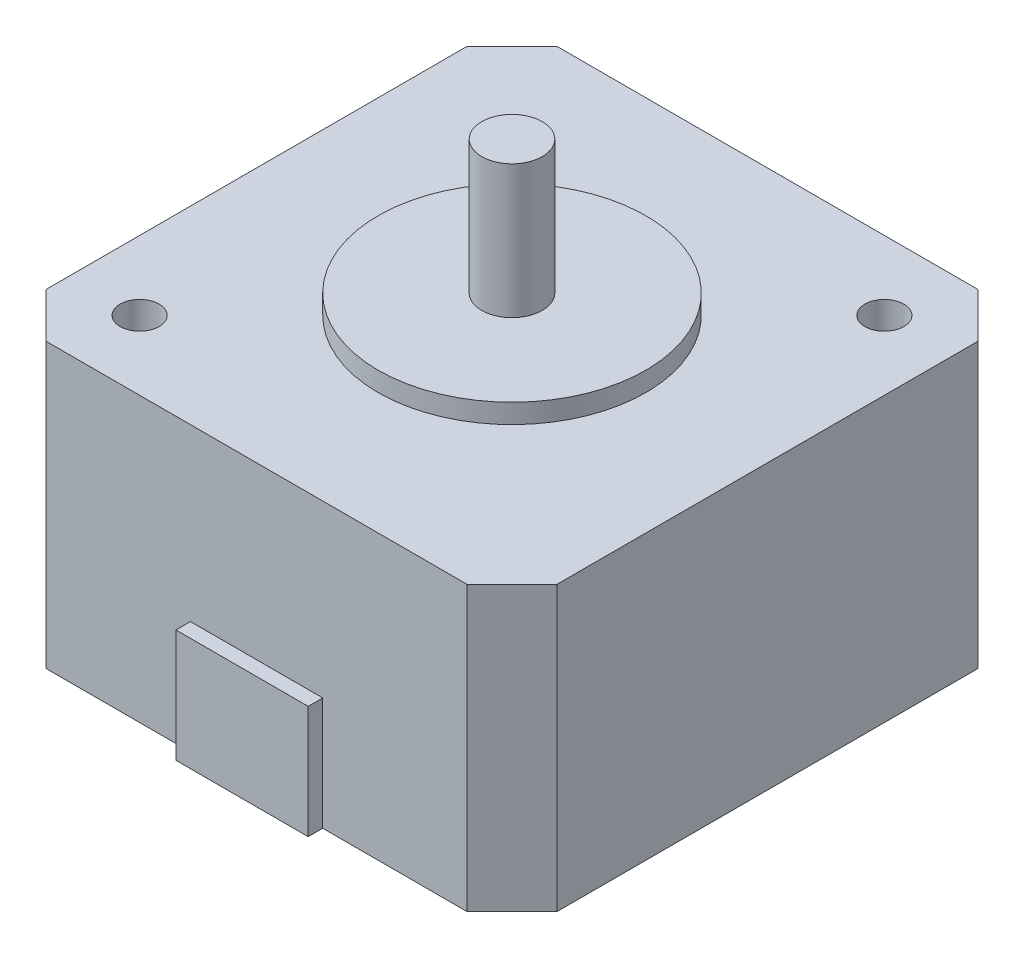
ISO-10303-21;
HEADER;
FILE_DESCRIPTION(('STEP AP214'),'2;1');
FILE_NAME('part.step','',(''),(''),'','','');
FILE_SCHEMA(('AUTOMOTIVE_DESIGN { 1 0 10303 214 1 1 1 1 }'));
ENDSEC;
DATA;
#1=APPLICATION_CONTEXT('core data for automotive mechanical design processes');
#2=APPLICATION_PROTOCOL_DEFINITION('international standard','automotive_design',2000,#1);
#3=PRODUCT_CONTEXT('',#1,'mechanical');
#4=PRODUCT('Part','Part','',(#3));
#5=PRODUCT_RELATED_PRODUCT_CATEGORY('part','',(#4));
#6=PRODUCT_DEFINITION_FORMATION('','',#4);
#7=PRODUCT_DEFINITION_CONTEXT('part definition',#1,'design');
#8=PRODUCT_DEFINITION('design','',#6,#7);
#9=PRODUCT_DEFINITION_SHAPE('','',#8);
#10=(LENGTH_UNIT() NAMED_UNIT(*) SI_UNIT(.MILLI.,.METRE.));
#11=(NAMED_UNIT(*) PLANE_ANGLE_UNIT() SI_UNIT($,.RADIAN.));
#12=(NAMED_UNIT(*) SI_UNIT($,.STERADIAN.) SOLID_ANGLE_UNIT());
#13=UNCERTAINTY_MEASURE_WITH_UNIT(LENGTH_MEASURE(1.E-05),#10,'distance_accuracy_value','');
#14=(GEOMETRIC_REPRESENTATION_CONTEXT(3) GLOBAL_UNCERTAINTY_ASSIGNED_CONTEXT((#13)) GLOBAL_UNIT_ASSIGNED_CONTEXT((#10,
#11,#12)) REPRESENTATION_CONTEXT('',''));
#15=CARTESIAN_POINT('',(0.,0.,0.));
#16=DIRECTION('',(0.,0.,1.));
#17=DIRECTION('',(1.,0.,0.));
#18=AXIS2_PLACEMENT_3D('',#15,#16,#17);
#19=CARTESIAN_POINT('',(0.,25.,0.));
#20=DIRECTION('',(0.,1.,0.));
#21=DIRECTION('',(0.,0.,1.));
#22=AXIS2_PLACEMENT_3D('',#19,#20,#21);
#23=PLANE('',#22);
#24=CARTESIAN_POINT('',(0.,25.,0.));
#25=DIRECTION('',(0.,1.,0.));
#26=DIRECTION('',(0.,0.,1.));
#27=AXIS2_PLACEMENT_3D('',#24,#25,#26);
#28=CIRCLE('',#27,11.05);
#29=CARTESIAN_POINT('',(0.,25.,11.05));
#30=VERTEX_POINT('',#29);
#31=EDGE_CURVE('E258',#30,#30,#28,.T.);
#32=ORIENTED_EDGE('',*,*,#31,.T.);
#33=EDGE_LOOP('',(#32));
#34=FACE_BOUND('',#33,.T.);
#35=CARTESIAN_POINT('',(0.,25.,0.));
#36=DIRECTION('',(0.,1.,0.));
#37=DIRECTION('',(0.,0.,1.));
#38=AXIS2_PLACEMENT_3D('',#35,#36,#37);
#39=CIRCLE('',#38,2.5);
#40=CARTESIAN_POINT('',(0.,25.,2.5));
#41=VERTEX_POINT('',#40);
#42=EDGE_CURVE('E265',#41,#41,#39,.T.);
#43=ORIENTED_EDGE('',*,*,#42,.F.);
#44=EDGE_LOOP('',(#43));
#45=FACE_BOUND('',#44,.T.);
#46=ADVANCED_FACE('F33',(#34,#45),#23,.T.);
#47=CARTESIAN_POINT('',(0.,23.4,0.));
#48=DIRECTION('',(0.,1.,0.));
#49=DIRECTION('',(0.,0.,1.));
#50=AXIS2_PLACEMENT_3D('',#47,#48,#49);
#51=PLANE('',#50);
#52=DIRECTION('',(-0.707106781186546,0.,-0.707106781186549));
#53=VECTOR('',#52,1.);
#54=CARTESIAN_POINT('',(17.385,23.4,-21.085));
#55=LINE('',#54,#53);
#56=CARTESIAN_POINT('',(21.085,23.4,-17.385));
#57=VERTEX_POINT('',#56);
#58=CARTESIAN_POINT('',(17.385,23.4,-21.085));
#59=VERTEX_POINT('',#58);
#60=EDGE_CURVE('E170',#57,#59,#55,.T.);
#61=ORIENTED_EDGE('',*,*,#60,.T.);
#62=DIRECTION('',(-1.,0.,0.));
#63=VECTOR('',#62,1.);
#64=CARTESIAN_POINT('',(-17.385,23.4,-21.085));
#65=LINE('',#64,#63);
#66=CARTESIAN_POINT('',(-17.385,23.4,-21.085));
#67=VERTEX_POINT('',#66);
#68=EDGE_CURVE('E173',#59,#67,#65,.T.);
#69=ORIENTED_EDGE('',*,*,#68,.T.);
#70=DIRECTION('',(-0.707106781186548,0.,0.707106781186547));
#71=VECTOR('',#70,1.);
#72=CARTESIAN_POINT('',(-21.085,23.4,-17.385));
#73=LINE('',#72,#71);
#74=CARTESIAN_POINT('',(-21.085,23.4,-17.385));
#75=VERTEX_POINT('',#74);
#76=EDGE_CURVE('E176',#67,#75,#73,.T.);
#77=ORIENTED_EDGE('',*,*,#76,.T.);
#78=DIRECTION('',(0.,0.,1.));
#79=VECTOR('',#78,1.);
#80=CARTESIAN_POINT('',(-21.085,23.4,-17.385));
#81=LINE('',#80,#79);
#82=CARTESIAN_POINT('',(-21.085,23.4,17.385));
#83=VERTEX_POINT('',#82);
#84=EDGE_CURVE('E178',#75,#83,#81,.T.);
#85=ORIENTED_EDGE('',*,*,#84,.T.);
#86=DIRECTION('',(0.707106781186547,0.,0.707106781186547));
#87=VECTOR('',#86,1.);
#88=CARTESIAN_POINT('',(-21.085,23.4,17.385));
#89=LINE('',#88,#87);
#90=CARTESIAN_POINT('',(-17.385,23.4,21.085));
#91=VERTEX_POINT('',#90);
#92=EDGE_CURVE('E180',#83,#91,#89,.T.);
#93=ORIENTED_EDGE('',*,*,#92,.T.);
#94=DIRECTION('',(1.,0.,0.));
#95=VECTOR('',#94,1.);
#96=CARTESIAN_POINT('',(-17.385,23.4,21.085));
#97=LINE('',#96,#95);
#98=CARTESIAN_POINT('',(17.385,23.4,21.085));
#99=VERTEX_POINT('',#98);
#100=EDGE_CURVE('E182',#91,#99,#97,.T.);
#101=ORIENTED_EDGE('',*,*,#100,.T.);
#102=DIRECTION('',(0.707106781186547,0.,-0.707106781186548));
#103=VECTOR('',#102,1.);
#104=CARTESIAN_POINT('',(17.385,23.4,21.085));
#105=LINE('',#104,#103);
#106=CARTESIAN_POINT('',(21.085,23.4,17.385));
#107=VERTEX_POINT('',#106);
#108=EDGE_CURVE('E184',#99,#107,#105,.T.);
#109=ORIENTED_EDGE('',*,*,#108,.T.);
#110=DIRECTION('',(0.,0.,-1.));
#111=VECTOR('',#110,1.);
#112=CARTESIAN_POINT('',(21.085,23.4,-17.385));
#113=LINE('',#112,#111);
#114=EDGE_CURVE('E186',#107,#57,#113,.T.);
#115=ORIENTED_EDGE('',*,*,#114,.T.);
#116=EDGE_LOOP('',(#61,#69,#77,#85,#93,#101,#109,#115));
#117=FACE_BOUND('',#116,.T.);
#118=CARTESIAN_POINT('',(-15.37,23.4,15.37));
#119=DIRECTION('',(0.,1.,0.));
#120=DIRECTION('',(0.,0.,1.));
#121=AXIS2_PLACEMENT_3D('',#118,#119,#120);
#122=CIRCLE('',#121,1.61);
#123=CARTESIAN_POINT('',(-15.37,23.4,16.98));
#124=VERTEX_POINT('',#123);
#125=EDGE_CURVE('E252',#124,#124,#122,.T.);
#126=ORIENTED_EDGE('',*,*,#125,.F.);
#127=EDGE_LOOP('',(#126));
#128=FACE_BOUND('',#127,.T.);
#129=CARTESIAN_POINT('',(15.37,23.4,-15.37));
#130=DIRECTION('',(0.,1.,0.));
#131=DIRECTION('',(0.,0.,1.));
#132=AXIS2_PLACEMENT_3D('',#129,#130,#131);
#133=CIRCLE('',#132,1.61);
#134=CARTESIAN_POINT('',(15.37,23.4,-13.76));
#135=VERTEX_POINT('',#134);
#136=EDGE_CURVE('E255',#135,#135,#133,.T.);
#137=ORIENTED_EDGE('',*,*,#136,.F.);
#138=EDGE_LOOP('',(#137));
#139=FACE_BOUND('',#138,.T.);
#140=CARTESIAN_POINT('',(0.,23.4,0.));
#141=DIRECTION('',(0.,1.,0.));
#142=DIRECTION('',(0.,0.,1.));
#143=AXIS2_PLACEMENT_3D('',#140,#141,#142);
#144=CIRCLE('',#143,11.05);
#145=CARTESIAN_POINT('',(0.,23.4,11.05));
#146=VERTEX_POINT('',#145);
#147=EDGE_CURVE('E259',#146,#146,#144,.T.);
#148=ORIENTED_EDGE('',*,*,#147,.F.);
#149=EDGE_LOOP('',(#148));
#150=FACE_BOUND('',#149,.T.);
#151=ADVANCED_FACE('F241',(#117,#128,#139,#150),#51,.T.);
#152=CARTESIAN_POINT('',(-17.385,23.4,21.085));
#153=DIRECTION('',(0.,0.,-1.));
#154=DIRECTION('',(-1.,0.,0.));
#155=AXIS2_PLACEMENT_3D('',#152,#153,#154);
#156=PLANE('',#155);
#157=DIRECTION('',(0.,-1.,0.));
#158=VECTOR('',#157,1.);
#159=CARTESIAN_POINT('',(-5.46,9.32,21.085));
#160=LINE('',#159,#158);
#161=CARTESIAN_POINT('',(-5.46,9.32,21.085));
#162=VERTEX_POINT('',#161);
#163=CARTESIAN_POINT('',(-5.46,0.,21.085));
#164=VERTEX_POINT('',#163);
#165=EDGE_CURVE('E50',#162,#164,#160,.T.);
#166=ORIENTED_EDGE('',*,*,#165,.F.);
#167=DIRECTION('',(-1.,0.,0.));
#168=VECTOR('',#167,1.);
#169=CARTESIAN_POINT('',(-5.46,9.32,21.085));
#170=LINE('',#169,#168);
#171=CARTESIAN_POINT('',(5.46,9.31999999999999,21.085));
#172=VERTEX_POINT('',#171);
#173=EDGE_CURVE('E144',#172,#162,#170,.T.);
#174=ORIENTED_EDGE('',*,*,#173,.F.);
#175=DIRECTION('',(0.,1.,0.));
#176=VECTOR('',#175,1.);
#177=CARTESIAN_POINT('',(5.46,9.31999999999999,21.085));
#178=LINE('',#177,#176);
#179=CARTESIAN_POINT('',(5.46,0.,21.085));
#180=VERTEX_POINT('',#179);
#181=EDGE_CURVE('E56',#180,#172,#178,.T.);
#182=ORIENTED_EDGE('',*,*,#181,.F.);
#183=DIRECTION('',(1.,0.,0.));
#184=VECTOR('',#183,1.);
#185=CARTESIAN_POINT('',(-17.385,0.,21.085));
#186=LINE('',#185,#184);
#187=CARTESIAN_POINT('',(17.385,0.,21.085));
#188=VERTEX_POINT('',#187);
#189=EDGE_CURVE('E196',#180,#188,#186,.T.);
#190=ORIENTED_EDGE('',*,*,#189,.T.);
#191=DIRECTION('',(0.,-1.,0.));
#192=VECTOR('',#191,1.);
#193=CARTESIAN_POINT('',(17.385,23.4,21.085));
#194=LINE('',#193,#192);
#195=EDGE_CURVE('E218',#99,#188,#194,.T.);
#196=ORIENTED_EDGE('',*,*,#195,.F.);
#197=ORIENTED_EDGE('',*,*,#100,.F.);
#198=DIRECTION('',(0.,-1.,0.));
#199=VECTOR('',#198,1.);
#200=CARTESIAN_POINT('',(-17.385,23.4,21.085));
#201=LINE('',#200,#199);
#202=CARTESIAN_POINT('',(-17.385,0.,21.085));
#203=VERTEX_POINT('',#202);
#204=EDGE_CURVE('E215',#91,#203,#201,.T.);
#205=ORIENTED_EDGE('',*,*,#204,.T.);
#206=EDGE_CURVE('E205',#203,#164,#186,.T.);
#207=ORIENTED_EDGE('',*,*,#206,.T.);
#208=EDGE_LOOP('',(#166,#174,#182,#190,#196,#197,#205,#207));
#209=FACE_BOUND('',#208,.T.);
#210=ADVANCED_FACE('F247',(#209),#156,.F.);
#211=CARTESIAN_POINT('',(17.385,23.4,-21.085));
#212=DIRECTION('',(-0.707106781186549,0.,0.707106781186546));
#213=DIRECTION('',(0.707106781186546,0.,0.707106781186549));
#214=AXIS2_PLACEMENT_3D('',#211,#212,#213);
#215=PLANE('',#214);
#216=DIRECTION('',(-0.707106781186546,0.,-0.707106781186549));
#217=VECTOR('',#216,1.);
#218=CARTESIAN_POINT('',(17.385,0.,-21.085));
#219=LINE('',#218,#217);
#220=CARTESIAN_POINT('',(21.085,0.,-17.385));
#221=VERTEX_POINT('',#220);
#222=CARTESIAN_POINT('',(17.385,0.,-21.085));
#223=VERTEX_POINT('',#222);
#224=EDGE_CURVE('E147',#221,#223,#219,.T.);
#225=ORIENTED_EDGE('',*,*,#224,.T.);
#226=DIRECTION('',(0.,-1.,0.));
#227=VECTOR('',#226,1.);
#228=CARTESIAN_POINT('',(17.385,23.4,-21.085));
#229=LINE('',#228,#227);
#230=EDGE_CURVE('E11',#59,#223,#229,.T.);
#231=ORIENTED_EDGE('',*,*,#230,.F.);
#232=ORIENTED_EDGE('',*,*,#60,.F.);
#233=DIRECTION('',(0.,-1.,0.));
#234=VECTOR('',#233,1.);
#235=CARTESIAN_POINT('',(21.085,23.4,-17.385));
#236=LINE('',#235,#234);
#237=EDGE_CURVE('E187',#57,#221,#236,.T.);
#238=ORIENTED_EDGE('',*,*,#237,.T.);
#239=EDGE_LOOP('',(#225,#231,#232,#238));
#240=FACE_BOUND('',#239,.T.);
#241=ADVANCED_FACE('F35',(#240),#215,.F.);
#242=CARTESIAN_POINT('',(-17.385,23.4,-21.085));
#243=DIRECTION('',(0.,0.,1.));
#244=DIRECTION('',(1.,0.,0.));
#245=AXIS2_PLACEMENT_3D('',#242,#243,#244);
#246=PLANE('',#245);
#247=DIRECTION('',(-1.,0.,0.));
#248=VECTOR('',#247,1.);
#249=CARTESIAN_POINT('',(-17.385,0.,-21.085));
#250=LINE('',#249,#248);
#251=CARTESIAN_POINT('',(-17.385,0.,-21.085));
#252=VERTEX_POINT('',#251);
#253=EDGE_CURVE('E150',#223,#252,#250,.T.);
#254=ORIENTED_EDGE('',*,*,#253,.T.);
#255=DIRECTION('',(0.,-1.,0.));
#256=VECTOR('',#255,1.);
#257=CARTESIAN_POINT('',(-17.385,23.4,-21.085));
#258=LINE('',#257,#256);
#259=EDGE_CURVE('E42',#67,#252,#258,.T.);
#260=ORIENTED_EDGE('',*,*,#259,.F.);
#261=ORIENTED_EDGE('',*,*,#68,.F.);
#262=ORIENTED_EDGE('',*,*,#230,.T.);
#263=EDGE_LOOP('',(#254,#260,#261,#262));
#264=FACE_BOUND('',#263,.T.);
#265=ADVANCED_FACE('F329',(#264),#246,.F.);
#266=CARTESIAN_POINT('',(-21.085,23.4,-17.385));
#267=DIRECTION('',(0.707106781186547,0.,0.707106781186548));
#268=DIRECTION('',(0.707106781186548,0.,-0.707106781186547));
#269=AXIS2_PLACEMENT_3D('',#266,#267,#268);
#270=PLANE('',#269);
#271=DIRECTION('',(-0.707106781186548,0.,0.707106781186547));
#272=VECTOR('',#271,1.);
#273=CARTESIAN_POINT('',(-21.085,0.,-17.385));
#274=LINE('',#273,#272);
#275=CARTESIAN_POINT('',(-21.085,0.,-17.385));
#276=VERTEX_POINT('',#275);
#277=EDGE_CURVE('E190',#252,#276,#274,.T.);
#278=ORIENTED_EDGE('',*,*,#277,.T.);
#279=DIRECTION('',(0.,-1.,0.));
#280=VECTOR('',#279,1.);
#281=CARTESIAN_POINT('',(-21.085,23.4,-17.385));
#282=LINE('',#281,#280);
#283=EDGE_CURVE('E209',#75,#276,#282,.T.);
#284=ORIENTED_EDGE('',*,*,#283,.F.);
#285=ORIENTED_EDGE('',*,*,#76,.F.);
#286=ORIENTED_EDGE('',*,*,#259,.T.);
#287=EDGE_LOOP('',(#278,#284,#285,#286));
#288=FACE_BOUND('',#287,.T.);
#289=ADVANCED_FACE('F326',(#288),#270,.F.);
#290=CARTESIAN_POINT('',(-21.085,23.4,-17.385));
#291=DIRECTION('',(1.,0.,0.));
#292=DIRECTION('',(0.,0.,-1.));
#293=AXIS2_PLACEMENT_3D('',#290,#291,#292);
#294=PLANE('',#293);
#295=DIRECTION('',(0.,0.,1.));
#296=VECTOR('',#295,1.);
#297=CARTESIAN_POINT('',(-21.085,0.,-17.385));
#298=LINE('',#297,#296);
#299=CARTESIAN_POINT('',(-21.085,0.,17.385));
#300=VERTEX_POINT('',#299);
#301=EDGE_CURVE('E192',#276,#300,#298,.T.);
#302=ORIENTED_EDGE('',*,*,#301,.T.);
#303=DIRECTION('',(0.,-1.,0.));
#304=VECTOR('',#303,1.);
#305=CARTESIAN_POINT('',(-21.085,23.4,17.385));
#306=LINE('',#305,#304);
#307=EDGE_CURVE('E212',#83,#300,#306,.T.);
#308=ORIENTED_EDGE('',*,*,#307,.F.);
#309=ORIENTED_EDGE('',*,*,#84,.F.);
#310=ORIENTED_EDGE('',*,*,#283,.T.);
#311=EDGE_LOOP('',(#302,#308,#309,#310));
#312=FACE_BOUND('',#311,.T.);
#313=ADVANCED_FACE('F322',(#312),#294,.F.);
#314=CARTESIAN_POINT('',(-21.085,23.4,17.385));
#315=DIRECTION('',(0.707106781186548,0.,-0.707106781186548));
#316=DIRECTION('',(-0.707106781186548,0.,-0.707106781186548));
#317=AXIS2_PLACEMENT_3D('',#314,#315,#316);
#318=PLANE('',#317);
#319=DIRECTION('',(0.707106781186547,0.,0.707106781186547));
#320=VECTOR('',#319,1.);
#321=CARTESIAN_POINT('',(-21.085,0.,17.385));
#322=LINE('',#321,#320);
#323=EDGE_CURVE('E194',#300,#203,#322,.T.);
#324=ORIENTED_EDGE('',*,*,#323,.T.);
#325=ORIENTED_EDGE('',*,*,#204,.F.);
#326=ORIENTED_EDGE('',*,*,#92,.F.);
#327=ORIENTED_EDGE('',*,*,#307,.T.);
#328=EDGE_LOOP('',(#324,#325,#326,#327));
#329=FACE_BOUND('',#328,.T.);
#330=ADVANCED_FACE('F317',(#329),#318,.F.);
#331=CARTESIAN_POINT('',(17.385,23.4,21.085));
#332=DIRECTION('',(-0.707106781186548,0.,-0.707106781186547));
#333=DIRECTION('',(-0.707106781186547,0.,0.707106781186548));
#334=AXIS2_PLACEMENT_3D('',#331,#332,#333);
#335=PLANE('',#334);
#336=DIRECTION('',(0.707106781186547,0.,-0.707106781186548));
#337=VECTOR('',#336,1.);
#338=CARTESIAN_POINT('',(17.385,0.,21.085));
#339=LINE('',#338,#337);
#340=CARTESIAN_POINT('',(21.085,0.,17.385));
#341=VERTEX_POINT('',#340);
#342=EDGE_CURVE('E199',#188,#341,#339,.T.);
#343=ORIENTED_EDGE('',*,*,#342,.T.);
#344=DIRECTION('',(0.,-1.,0.));
#345=VECTOR('',#344,1.);
#346=CARTESIAN_POINT('',(21.085,23.4,17.385));
#347=LINE('',#346,#345);
#348=EDGE_CURVE('E221',#107,#341,#347,.T.);
#349=ORIENTED_EDGE('',*,*,#348,.F.);
#350=ORIENTED_EDGE('',*,*,#108,.F.);
#351=ORIENTED_EDGE('',*,*,#195,.T.);
#352=EDGE_LOOP('',(#343,#349,#350,#351));
#353=FACE_BOUND('',#352,.T.);
#354=ADVANCED_FACE('F231',(#353),#335,.F.);
#355=CARTESIAN_POINT('',(21.085,23.4,-17.385));
#356=DIRECTION('',(-1.,0.,0.));
#357=DIRECTION('',(0.,0.,1.));
#358=AXIS2_PLACEMENT_3D('',#355,#356,#357);
#359=PLANE('',#358);
#360=DIRECTION('',(0.,0.,-1.));
#361=VECTOR('',#360,1.);
#362=CARTESIAN_POINT('',(21.085,0.,-17.385));
#363=LINE('',#362,#361);
#364=EDGE_CURVE('E174',#341,#221,#363,.T.);
#365=ORIENTED_EDGE('',*,*,#364,.T.);
#366=ORIENTED_EDGE('',*,*,#237,.F.);
#367=ORIENTED_EDGE('',*,*,#114,.F.);
#368=ORIENTED_EDGE('',*,*,#348,.T.);
#369=EDGE_LOOP('',(#365,#366,#367,#368));
#370=FACE_BOUND('',#369,.T.);
#371=ADVANCED_FACE('F235',(#370),#359,.F.);
#372=CARTESIAN_POINT('',(0.,0.,0.));
#373=DIRECTION('',(0.,1.,0.));
#374=DIRECTION('',(0.,0.,1.));
#375=AXIS2_PLACEMENT_3D('',#372,#373,#374);
#376=PLANE('',#375);
#377=CARTESIAN_POINT('',(15.37,0.,-15.37));
#378=DIRECTION('',(0.,1.,0.));
#379=DIRECTION('',(0.,0.,1.));
#380=AXIS2_PLACEMENT_3D('',#377,#378,#379);
#381=CIRCLE('',#380,1.61);
#382=CARTESIAN_POINT('',(15.37,0.,-13.76));
#383=VERTEX_POINT('',#382);
#384=EDGE_CURVE('E37',#383,#383,#381,.T.);
#385=ORIENTED_EDGE('',*,*,#384,.T.);
#386=EDGE_LOOP('',(#385));
#387=FACE_BOUND('',#386,.T.);
#388=CARTESIAN_POINT('',(-15.37,0.,15.37));
#389=DIRECTION('',(0.,1.,0.));
#390=DIRECTION('',(0.,0.,1.));
#391=AXIS2_PLACEMENT_3D('',#388,#389,#390);
#392=CIRCLE('',#391,1.61);
#393=CARTESIAN_POINT('',(-15.37,0.,16.98));
#394=VERTEX_POINT('',#393);
#395=EDGE_CURVE('E160',#394,#394,#392,.T.);
#396=ORIENTED_EDGE('',*,*,#395,.T.);
#397=EDGE_LOOP('',(#396));
#398=FACE_BOUND('',#397,.T.);
#399=ORIENTED_EDGE('',*,*,#224,.F.);
#400=ORIENTED_EDGE('',*,*,#364,.F.);
#401=ORIENTED_EDGE('',*,*,#342,.F.);
#402=ORIENTED_EDGE('',*,*,#189,.F.);
#403=DIRECTION('',(0.,0.,-1.));
#404=VECTOR('',#403,1.);
#405=CARTESIAN_POINT('',(5.46,0.,22.285));
#406=LINE('',#405,#404);
#407=CARTESIAN_POINT('',(5.46,0.,22.285));
#408=VERTEX_POINT('',#407);
#409=EDGE_CURVE('E131',#408,#180,#406,.T.);
#410=ORIENTED_EDGE('',*,*,#409,.F.);
#411=DIRECTION('',(1.,0.,0.));
#412=VECTOR('',#411,1.);
#413=CARTESIAN_POINT('',(-5.46,0.,22.285));
#414=LINE('',#413,#412);
#415=CARTESIAN_POINT('',(-5.46,0.,22.285));
#416=VERTEX_POINT('',#415);
#417=EDGE_CURVE('E123',#416,#408,#414,.T.);
#418=ORIENTED_EDGE('',*,*,#417,.F.);
#419=DIRECTION('',(0.,0.,-1.));
#420=VECTOR('',#419,1.);
#421=CARTESIAN_POINT('',(-5.46,0.,22.285));
#422=LINE('',#421,#420);
#423=EDGE_CURVE('E129',#416,#164,#422,.T.);
#424=ORIENTED_EDGE('',*,*,#423,.T.);
#425=ORIENTED_EDGE('',*,*,#206,.F.);
#426=ORIENTED_EDGE('',*,*,#323,.F.);
#427=ORIENTED_EDGE('',*,*,#301,.F.);
#428=ORIENTED_EDGE('',*,*,#277,.F.);
#429=ORIENTED_EDGE('',*,*,#253,.F.);
#430=EDGE_LOOP('',(#399,#400,#401,#402,#410,#418,#424,#425,#426,#427,#428,#429));
#431=FACE_BOUND('',#430,.T.);
#432=ADVANCED_FACE('F126',(#387,#398,#431),#376,.F.);
#433=CARTESIAN_POINT('',(-5.46,9.32,22.285));
#434=DIRECTION('',(1.,0.,0.));
#435=DIRECTION('',(0.,0.,-1.));
#436=AXIS2_PLACEMENT_3D('',#433,#434,#435);
#437=PLANE('',#436);
#438=ORIENTED_EDGE('',*,*,#165,.T.);
#439=ORIENTED_EDGE('',*,*,#423,.F.);
#440=DIRECTION('',(0.,-1.,0.));
#441=VECTOR('',#440,1.);
#442=CARTESIAN_POINT('',(-5.46,9.32,22.285));
#443=LINE('',#442,#441);
#444=CARTESIAN_POINT('',(-5.46,9.32,22.285));
#445=VERTEX_POINT('',#444);
#446=EDGE_CURVE('E135',#445,#416,#443,.T.);
#447=ORIENTED_EDGE('',*,*,#446,.F.);
#448=DIRECTION('',(0.,0.,-1.));
#449=VECTOR('',#448,1.);
#450=CARTESIAN_POINT('',(-5.46,9.32,22.285));
#451=LINE('',#450,#449);
#452=EDGE_CURVE('E166',#445,#162,#451,.T.);
#453=ORIENTED_EDGE('',*,*,#452,.T.);
#454=EDGE_LOOP('',(#438,#439,#447,#453));
#455=FACE_BOUND('',#454,.T.);
#456=ADVANCED_FACE('F146',(#455),#437,.F.);
#457=CARTESIAN_POINT('',(5.46,9.31999999999999,22.285));
#458=DIRECTION('',(-1.,0.,0.));
#459=DIRECTION('',(0.,0.,1.));
#460=AXIS2_PLACEMENT_3D('',#457,#458,#459);
#461=PLANE('',#460);
#462=ORIENTED_EDGE('',*,*,#181,.T.);
#463=DIRECTION('',(0.,0.,-1.));
#464=VECTOR('',#463,1.);
#465=CARTESIAN_POINT('',(5.46,9.31999999999999,22.285));
#466=LINE('',#465,#464);
#467=CARTESIAN_POINT('',(5.46,9.31999999999999,22.285));
#468=VERTEX_POINT('',#467);
#469=EDGE_CURVE('E152',#468,#172,#466,.T.);
#470=ORIENTED_EDGE('',*,*,#469,.F.);
#471=DIRECTION('',(0.,1.,0.));
#472=VECTOR('',#471,1.);
#473=CARTESIAN_POINT('',(5.46,9.31999999999999,22.285));
#474=LINE('',#473,#472);
#475=EDGE_CURVE('E134',#408,#468,#474,.T.);
#476=ORIENTED_EDGE('',*,*,#475,.F.);
#477=ORIENTED_EDGE('',*,*,#409,.T.);
#478=EDGE_LOOP('',(#462,#470,#476,#477));
#479=FACE_BOUND('',#478,.T.);
#480=ADVANCED_FACE('F249',(#479),#461,.F.);
#481=CARTESIAN_POINT('',(-5.46,9.32,22.285));
#482=DIRECTION('',(0.,-1.,0.));
#483=DIRECTION('',(1.,0.,0.));
#484=AXIS2_PLACEMENT_3D('',#481,#482,#483);
#485=PLANE('',#484);
#486=ORIENTED_EDGE('',*,*,#173,.T.);
#487=ORIENTED_EDGE('',*,*,#452,.F.);
#488=DIRECTION('',(-1.,0.,0.));
#489=VECTOR('',#488,1.);
#490=CARTESIAN_POINT('',(-5.46,9.32,22.285));
#491=LINE('',#490,#489);
#492=EDGE_CURVE('E140',#468,#445,#491,.T.);
#493=ORIENTED_EDGE('',*,*,#492,.F.);
#494=ORIENTED_EDGE('',*,*,#469,.T.);
#495=EDGE_LOOP('',(#486,#487,#493,#494));
#496=FACE_BOUND('',#495,.T.);
#497=ADVANCED_FACE('F302',(#496),#485,.F.);
#498=CARTESIAN_POINT('',(0.,0.,22.285));
#499=DIRECTION('',(0.,0.,1.));
#500=DIRECTION('',(1.,0.,0.));
#501=AXIS2_PLACEMENT_3D('',#498,#499,#500);
#502=PLANE('',#501);
#503=ORIENTED_EDGE('',*,*,#446,.T.);
#504=ORIENTED_EDGE('',*,*,#417,.T.);
#505=ORIENTED_EDGE('',*,*,#475,.T.);
#506=ORIENTED_EDGE('',*,*,#492,.T.);
#507=EDGE_LOOP('',(#503,#504,#505,#506));
#508=FACE_BOUND('',#507,.T.);
#509=ADVANCED_FACE('F138',(#508),#502,.T.);
#510=CARTESIAN_POINT('',(-15.37,-5.00000000014378E-05,15.37));
#511=DIRECTION('',(0.,1.,0.));
#512=DIRECTION('',(0.,0.,1.));
#513=AXIS2_PLACEMENT_3D('',#510,#511,#512);
#514=CYLINDRICAL_SURFACE('',#513,1.61);
#515=ORIENTED_EDGE('',*,*,#125,.T.);
#516=EDGE_LOOP('',(#515));
#517=FACE_BOUND('',#516,.T.);
#518=ORIENTED_EDGE('',*,*,#395,.F.);
#519=EDGE_LOOP('',(#518));
#520=FACE_BOUND('',#519,.T.);
#521=ADVANCED_FACE('F295',(#517,#520),#514,.F.);
#522=CARTESIAN_POINT('',(15.37,-5.00000000014378E-05,-15.37));
#523=DIRECTION('',(0.,1.,0.));
#524=DIRECTION('',(0.,0.,1.));
#525=AXIS2_PLACEMENT_3D('',#522,#523,#524);
#526=CYLINDRICAL_SURFACE('',#525,1.61);
#527=ORIENTED_EDGE('',*,*,#136,.T.);
#528=EDGE_LOOP('',(#527));
#529=FACE_BOUND('',#528,.T.);
#530=ORIENTED_EDGE('',*,*,#384,.F.);
#531=EDGE_LOOP('',(#530));
#532=FACE_BOUND('',#531,.T.);
#533=ADVANCED_FACE('F291',(#529,#532),#526,.F.);
#534=CARTESIAN_POINT('',(0.,25.,0.));
#535=DIRECTION('',(0.,-1.,0.));
#536=DIRECTION('',(0.,0.,-1.));
#537=AXIS2_PLACEMENT_3D('',#534,#535,#536);
#538=CYLINDRICAL_SURFACE('',#537,11.05);
#539=ORIENTED_EDGE('',*,*,#31,.F.);
#540=EDGE_LOOP('',(#539));
#541=FACE_BOUND('',#540,.T.);
#542=ORIENTED_EDGE('',*,*,#147,.T.);
#543=EDGE_LOOP('',(#542));
#544=FACE_BOUND('',#543,.T.);
#545=ADVANCED_FACE('F276',(#541,#544),#538,.T.);
#546=CARTESIAN_POINT('',(0.,36.,0.));
#547=DIRECTION('',(0.,-1.,0.));
#548=DIRECTION('',(0.,0.,-1.));
#549=AXIS2_PLACEMENT_3D('',#546,#547,#548);
#550=CYLINDRICAL_SURFACE('',#549,2.5);
#551=CARTESIAN_POINT('',(0.,36.,0.));
#552=DIRECTION('',(0.,1.,0.));
#553=DIRECTION('',(0.,0.,1.));
#554=AXIS2_PLACEMENT_3D('',#551,#552,#553);
#555=CIRCLE('',#554,2.5);
#556=CARTESIAN_POINT('',(0.,36.,2.5));
#557=VERTEX_POINT('',#556);
#558=EDGE_CURVE('E262',#557,#557,#555,.T.);
#559=ORIENTED_EDGE('',*,*,#558,.F.);
#560=EDGE_LOOP('',(#559));
#561=FACE_BOUND('',#560,.T.);
#562=ORIENTED_EDGE('',*,*,#42,.T.);
#563=EDGE_LOOP('',(#562));
#564=FACE_BOUND('',#563,.T.);
#565=ADVANCED_FACE('F273',(#561,#564),#550,.T.);
#566=CARTESIAN_POINT('',(0.,36.,0.));
#567=DIRECTION('',(0.,1.,0.));
#568=DIRECTION('',(0.,0.,1.));
#569=AXIS2_PLACEMENT_3D('',#566,#567,#568);
#570=PLANE('',#569);
#571=ORIENTED_EDGE('',*,*,#558,.T.);
#572=EDGE_LOOP('',(#571));
#573=FACE_BOUND('',#572,.T.);
#574=ADVANCED_FACE('F271',(#573),#570,.T.);
#575=CLOSED_SHELL('',(#46,#151,#210,#241,#265,#289,#313,#330,#354,#371,#432,#456,#480,#497,#509,
#521,#533,#545,#565,#574));
#576=MANIFOLD_SOLID_BREP('B2',#575);
#577=ADVANCED_BREP_SHAPE_REPRESENTATION('',(#18,#576),#14);
#578=SHAPE_DEFINITION_REPRESENTATION(#9,#577);
ENDSEC;
END-ISO-10303-21;
